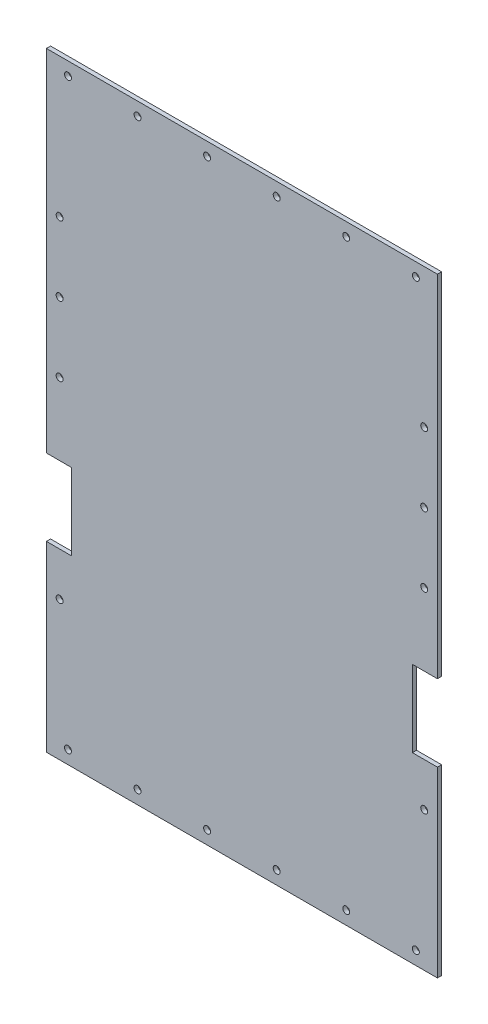
ISO-10303-21;
HEADER;
FILE_DESCRIPTION(('STEP AP214'),'2;1');
FILE_NAME('part.step','',(''),(''),'','','');
FILE_SCHEMA(('AUTOMOTIVE_DESIGN { 1 0 10303 214 1 1 1 1 }'));
ENDSEC;
DATA;
#1=APPLICATION_CONTEXT('core data for automotive mechanical design processes');
#2=APPLICATION_PROTOCOL_DEFINITION('international standard','automotive_design',2000,#1);
#3=PRODUCT_CONTEXT('',#1,'mechanical');
#4=PRODUCT('Part','Part','',(#3));
#5=PRODUCT_RELATED_PRODUCT_CATEGORY('part','',(#4));
#6=PRODUCT_DEFINITION_FORMATION('','',#4);
#7=PRODUCT_DEFINITION_CONTEXT('part definition',#1,'design');
#8=PRODUCT_DEFINITION('design','',#6,#7);
#9=PRODUCT_DEFINITION_SHAPE('','',#8);
#10=(LENGTH_UNIT() NAMED_UNIT(*) SI_UNIT(.MILLI.,.METRE.));
#11=(NAMED_UNIT(*) PLANE_ANGLE_UNIT() SI_UNIT($,.RADIAN.));
#12=(NAMED_UNIT(*) SI_UNIT($,.STERADIAN.) SOLID_ANGLE_UNIT());
#13=UNCERTAINTY_MEASURE_WITH_UNIT(LENGTH_MEASURE(1.E-05),#10,'distance_accuracy_value','');
#14=(GEOMETRIC_REPRESENTATION_CONTEXT(3) GLOBAL_UNCERTAINTY_ASSIGNED_CONTEXT((#13)) GLOBAL_UNIT_ASSIGNED_CONTEXT((#10,
#11,#12)) REPRESENTATION_CONTEXT('',''));
#15=CARTESIAN_POINT('',(0.,0.,0.));
#16=DIRECTION('',(0.,0.,1.));
#17=DIRECTION('',(1.,0.,0.));
#18=AXIS2_PLACEMENT_3D('',#15,#16,#17);
#19=CARTESIAN_POINT('',(0.,0.,3.));
#20=DIRECTION('',(1.,0.,0.));
#21=DIRECTION('',(0.,0.,-1.));
#22=AXIS2_PLACEMENT_3D('',#19,#20,#21);
#23=PLANE('',#22);
#24=DIRECTION('',(0.,-1.,0.));
#25=VECTOR('',#24,1.);
#26=CARTESIAN_POINT('',(0.,0.,0.));
#27=LINE('',#26,#25);
#28=CARTESIAN_POINT('',(0.,131.26,0.));
#29=VERTEX_POINT('',#28);
#30=CARTESIAN_POINT('',(0.,0.,0.));
#31=VERTEX_POINT('',#30);
#32=EDGE_CURVE('E168',#29,#31,#27,.T.);
#33=ORIENTED_EDGE('',*,*,#32,.T.);
#34=DIRECTION('',(0.,0.,-1.));
#35=VECTOR('',#34,1.);
#36=CARTESIAN_POINT('',(0.,0.,3.));
#37=LINE('',#36,#35);
#38=CARTESIAN_POINT('',(0.,0.,3.));
#39=VERTEX_POINT('',#38);
#40=EDGE_CURVE('E11',#39,#31,#37,.T.);
#41=ORIENTED_EDGE('',*,*,#40,.F.);
#42=DIRECTION('',(0.,-1.,0.));
#43=VECTOR('',#42,1.);
#44=CARTESIAN_POINT('',(0.,0.,3.));
#45=LINE('',#44,#43);
#46=CARTESIAN_POINT('',(0.,131.26,3.));
#47=VERTEX_POINT('',#46);
#48=EDGE_CURVE('E203',#47,#39,#45,.T.);
#49=ORIENTED_EDGE('',*,*,#48,.F.);
#50=DIRECTION('',(0.,0.,-1.));
#51=VECTOR('',#50,1.);
#52=CARTESIAN_POINT('',(0.,131.26,3.));
#53=LINE('',#52,#51);
#54=EDGE_CURVE('E164',#47,#29,#53,.T.);
#55=ORIENTED_EDGE('',*,*,#54,.T.);
#56=EDGE_LOOP('',(#33,#41,#49,#55));
#57=FACE_BOUND('',#56,.T.);
#58=ADVANCED_FACE('F43',(#57),#23,.F.);
#59=CARTESIAN_POINT('',(0.,0.,3.));
#60=DIRECTION('',(0.,1.,0.));
#61=DIRECTION('',(0.,0.,1.));
#62=AXIS2_PLACEMENT_3D('',#59,#60,#61);
#63=PLANE('',#62);
#64=DIRECTION('',(1.,0.,0.));
#65=VECTOR('',#64,1.);
#66=CARTESIAN_POINT('',(0.,0.,0.));
#67=LINE('',#66,#65);
#68=CARTESIAN_POINT('',(281.05,0.,0.));
#69=VERTEX_POINT('',#68);
#70=EDGE_CURVE('E172',#31,#69,#67,.T.);
#71=ORIENTED_EDGE('',*,*,#70,.T.);
#72=DIRECTION('',(0.,0.,-1.));
#73=VECTOR('',#72,1.);
#74=CARTESIAN_POINT('',(281.05,0.,3.));
#75=LINE('',#74,#73);
#76=CARTESIAN_POINT('',(281.05,0.,3.));
#77=VERTEX_POINT('',#76);
#78=EDGE_CURVE('E52',#77,#69,#75,.T.);
#79=ORIENTED_EDGE('',*,*,#78,.F.);
#80=DIRECTION('',(1.,0.,0.));
#81=VECTOR('',#80,1.);
#82=CARTESIAN_POINT('',(0.,0.,3.));
#83=LINE('',#82,#81);
#84=EDGE_CURVE('E115',#39,#77,#83,.T.);
#85=ORIENTED_EDGE('',*,*,#84,.F.);
#86=ORIENTED_EDGE('',*,*,#40,.T.);
#87=EDGE_LOOP('',(#71,#79,#85,#86));
#88=FACE_BOUND('',#87,.T.);
#89=ADVANCED_FACE('F298',(#88),#63,.F.);
#90=CARTESIAN_POINT('',(281.05,0.,3.));
#91=DIRECTION('',(-1.,0.,0.));
#92=DIRECTION('',(0.,0.,1.));
#93=AXIS2_PLACEMENT_3D('',#90,#91,#92);
#94=PLANE('',#93);
#95=DIRECTION('',(0.,1.,0.));
#96=VECTOR('',#95,1.);
#97=CARTESIAN_POINT('',(281.05,0.,0.));
#98=LINE('',#97,#96);
#99=CARTESIAN_POINT('',(281.05,131.26,0.));
#100=VERTEX_POINT('',#99);
#101=EDGE_CURVE('E176',#69,#100,#98,.T.);
#102=ORIENTED_EDGE('',*,*,#101,.T.);
#103=DIRECTION('',(0.,0.,-1.));
#104=VECTOR('',#103,1.);
#105=CARTESIAN_POINT('',(281.05,131.26,3.));
#106=LINE('',#105,#104);
#107=CARTESIAN_POINT('',(281.05,131.26,3.));
#108=VERTEX_POINT('',#107);
#109=EDGE_CURVE('E230',#108,#100,#106,.T.);
#110=ORIENTED_EDGE('',*,*,#109,.F.);
#111=DIRECTION('',(0.,1.,0.));
#112=VECTOR('',#111,1.);
#113=CARTESIAN_POINT('',(281.05,0.,3.));
#114=LINE('',#113,#112);
#115=EDGE_CURVE('E240',#77,#108,#114,.T.);
#116=ORIENTED_EDGE('',*,*,#115,.F.);
#117=ORIENTED_EDGE('',*,*,#78,.T.);
#118=EDGE_LOOP('',(#102,#110,#116,#117));
#119=FACE_BOUND('',#118,.T.);
#120=ADVANCED_FACE('F238',(#119),#94,.F.);
#121=CARTESIAN_POINT('',(281.05,131.26,3.));
#122=DIRECTION('',(0.,-1.,0.));
#123=DIRECTION('',(0.,0.,-1.));
#124=AXIS2_PLACEMENT_3D('',#121,#122,#123);
#125=PLANE('',#124);
#126=DIRECTION('',(-1.,0.,0.));
#127=VECTOR('',#126,1.);
#128=CARTESIAN_POINT('',(281.05,131.26,0.));
#129=LINE('',#128,#127);
#130=CARTESIAN_POINT('',(263.05,131.26,0.));
#131=VERTEX_POINT('',#130);
#132=EDGE_CURVE('E179',#100,#131,#129,.T.);
#133=ORIENTED_EDGE('',*,*,#132,.T.);
#134=DIRECTION('',(0.,0.,-1.));
#135=VECTOR('',#134,1.);
#136=CARTESIAN_POINT('',(263.05,131.26,3.));
#137=LINE('',#136,#135);
#138=CARTESIAN_POINT('',(263.05,131.26,3.));
#139=VERTEX_POINT('',#138);
#140=EDGE_CURVE('E226',#139,#131,#137,.T.);
#141=ORIENTED_EDGE('',*,*,#140,.F.);
#142=DIRECTION('',(-1.,0.,0.));
#143=VECTOR('',#142,1.);
#144=CARTESIAN_POINT('',(281.05,131.26,3.));
#145=LINE('',#144,#143);
#146=EDGE_CURVE('E259',#108,#139,#145,.T.);
#147=ORIENTED_EDGE('',*,*,#146,.F.);
#148=ORIENTED_EDGE('',*,*,#109,.T.);
#149=EDGE_LOOP('',(#133,#141,#147,#148));
#150=FACE_BOUND('',#149,.T.);
#151=ADVANCED_FACE('F249',(#150),#125,.F.);
#152=CARTESIAN_POINT('',(263.05,186.26,3.));
#153=DIRECTION('',(-1.,0.,0.));
#154=DIRECTION('',(0.,0.,1.));
#155=AXIS2_PLACEMENT_3D('',#152,#153,#154);
#156=PLANE('',#155);
#157=DIRECTION('',(0.,1.,0.));
#158=VECTOR('',#157,1.);
#159=CARTESIAN_POINT('',(263.05,186.26,0.));
#160=LINE('',#159,#158);
#161=CARTESIAN_POINT('',(263.05,186.26,0.));
#162=VERTEX_POINT('',#161);
#163=EDGE_CURVE('E182',#131,#162,#160,.T.);
#164=ORIENTED_EDGE('',*,*,#163,.T.);
#165=DIRECTION('',(0.,0.,-1.));
#166=VECTOR('',#165,1.);
#167=CARTESIAN_POINT('',(263.05,186.26,3.));
#168=LINE('',#167,#166);
#169=CARTESIAN_POINT('',(263.05,186.26,3.));
#170=VERTEX_POINT('',#169);
#171=EDGE_CURVE('E222',#170,#162,#168,.T.);
#172=ORIENTED_EDGE('',*,*,#171,.F.);
#173=DIRECTION('',(0.,1.,0.));
#174=VECTOR('',#173,1.);
#175=CARTESIAN_POINT('',(263.05,186.26,3.));
#176=LINE('',#175,#174);
#177=EDGE_CURVE('E255',#139,#170,#176,.T.);
#178=ORIENTED_EDGE('',*,*,#177,.F.);
#179=ORIENTED_EDGE('',*,*,#140,.T.);
#180=EDGE_LOOP('',(#164,#172,#178,#179));
#181=FACE_BOUND('',#180,.T.);
#182=ADVANCED_FACE('F253',(#181),#156,.F.);
#183=CARTESIAN_POINT('',(281.05,186.26,3.));
#184=DIRECTION('',(0.,1.,0.));
#185=DIRECTION('',(0.,0.,1.));
#186=AXIS2_PLACEMENT_3D('',#183,#184,#185);
#187=PLANE('',#186);
#188=DIRECTION('',(1.,0.,0.));
#189=VECTOR('',#188,1.);
#190=CARTESIAN_POINT('',(281.05,186.26,0.));
#191=LINE('',#190,#189);
#192=CARTESIAN_POINT('',(281.05,186.26,0.));
#193=VERTEX_POINT('',#192);
#194=EDGE_CURVE('E185',#162,#193,#191,.T.);
#195=ORIENTED_EDGE('',*,*,#194,.T.);
#196=DIRECTION('',(0.,0.,-1.));
#197=VECTOR('',#196,1.);
#198=CARTESIAN_POINT('',(281.05,186.26,3.));
#199=LINE('',#198,#197);
#200=CARTESIAN_POINT('',(281.05,186.26,3.));
#201=VERTEX_POINT('',#200);
#202=EDGE_CURVE('E218',#201,#193,#199,.T.);
#203=ORIENTED_EDGE('',*,*,#202,.F.);
#204=DIRECTION('',(1.,0.,0.));
#205=VECTOR('',#204,1.);
#206=CARTESIAN_POINT('',(281.05,186.26,3.));
#207=LINE('',#206,#205);
#208=EDGE_CURVE('E258',#170,#201,#207,.T.);
#209=ORIENTED_EDGE('',*,*,#208,.F.);
#210=ORIENTED_EDGE('',*,*,#171,.T.);
#211=EDGE_LOOP('',(#195,#203,#209,#210));
#212=FACE_BOUND('',#211,.T.);
#213=ADVANCED_FACE('F311',(#212),#187,.F.);
#214=CARTESIAN_POINT('',(281.05,186.26,3.));
#215=DIRECTION('',(-1.,0.,0.));
#216=DIRECTION('',(0.,0.,1.));
#217=AXIS2_PLACEMENT_3D('',#214,#215,#216);
#218=PLANE('',#217);
#219=DIRECTION('',(0.,1.,0.));
#220=VECTOR('',#219,1.);
#221=CARTESIAN_POINT('',(281.05,186.26,0.));
#222=LINE('',#221,#220);
#223=CARTESIAN_POINT('',(281.05,438.1,0.));
#224=VERTEX_POINT('',#223);
#225=EDGE_CURVE('E188',#193,#224,#222,.T.);
#226=ORIENTED_EDGE('',*,*,#225,.T.);
#227=DIRECTION('',(0.,0.,-1.));
#228=VECTOR('',#227,1.);
#229=CARTESIAN_POINT('',(281.05,438.1,3.));
#230=LINE('',#229,#228);
#231=CARTESIAN_POINT('',(281.05,438.1,3.));
#232=VERTEX_POINT('',#231);
#233=EDGE_CURVE('E214',#232,#224,#230,.T.);
#234=ORIENTED_EDGE('',*,*,#233,.F.);
#235=DIRECTION('',(0.,1.,0.));
#236=VECTOR('',#235,1.);
#237=CARTESIAN_POINT('',(281.05,186.26,3.));
#238=LINE('',#237,#236);
#239=EDGE_CURVE('E263',#201,#232,#238,.T.);
#240=ORIENTED_EDGE('',*,*,#239,.F.);
#241=ORIENTED_EDGE('',*,*,#202,.T.);
#242=EDGE_LOOP('',(#226,#234,#240,#241));
#243=FACE_BOUND('',#242,.T.);
#244=ADVANCED_FACE('F314',(#243),#218,.F.);
#245=CARTESIAN_POINT('',(0.,438.1,3.));
#246=DIRECTION('',(0.,-1.,0.));
#247=DIRECTION('',(0.,0.,-1.));
#248=AXIS2_PLACEMENT_3D('',#245,#246,#247);
#249=PLANE('',#248);
#250=DIRECTION('',(-1.,0.,0.));
#251=VECTOR('',#250,1.);
#252=CARTESIAN_POINT('',(0.,438.1,0.));
#253=LINE('',#252,#251);
#254=CARTESIAN_POINT('',(0.,438.1,0.));
#255=VERTEX_POINT('',#254);
#256=EDGE_CURVE('E191',#224,#255,#253,.T.);
#257=ORIENTED_EDGE('',*,*,#256,.T.);
#258=DIRECTION('',(0.,0.,-1.));
#259=VECTOR('',#258,1.);
#260=CARTESIAN_POINT('',(0.,438.1,3.));
#261=LINE('',#260,#259);
#262=CARTESIAN_POINT('',(0.,438.1,3.));
#263=VERTEX_POINT('',#262);
#264=EDGE_CURVE('E210',#263,#255,#261,.T.);
#265=ORIENTED_EDGE('',*,*,#264,.F.);
#266=DIRECTION('',(-1.,0.,0.));
#267=VECTOR('',#266,1.);
#268=CARTESIAN_POINT('',(0.,438.1,3.));
#269=LINE('',#268,#267);
#270=EDGE_CURVE('E270',#232,#263,#269,.T.);
#271=ORIENTED_EDGE('',*,*,#270,.F.);
#272=ORIENTED_EDGE('',*,*,#233,.T.);
#273=EDGE_LOOP('',(#257,#265,#271,#272));
#274=FACE_BOUND('',#273,.T.);
#275=ADVANCED_FACE('F278',(#274),#249,.F.);
#276=CARTESIAN_POINT('',(0.,186.26,3.));
#277=DIRECTION('',(1.,0.,0.));
#278=DIRECTION('',(0.,0.,-1.));
#279=AXIS2_PLACEMENT_3D('',#276,#277,#278);
#280=PLANE('',#279);
#281=DIRECTION('',(0.,-1.,0.));
#282=VECTOR('',#281,1.);
#283=CARTESIAN_POINT('',(0.,186.26,0.));
#284=LINE('',#283,#282);
#285=CARTESIAN_POINT('',(0.,186.26,0.));
#286=VERTEX_POINT('',#285);
#287=EDGE_CURVE('E194',#255,#286,#284,.T.);
#288=ORIENTED_EDGE('',*,*,#287,.T.);
#289=DIRECTION('',(0.,0.,-1.));
#290=VECTOR('',#289,1.);
#291=CARTESIAN_POINT('',(0.,186.26,3.));
#292=LINE('',#291,#290);
#293=CARTESIAN_POINT('',(0.,186.26,3.));
#294=VERTEX_POINT('',#293);
#295=EDGE_CURVE('E157',#294,#286,#292,.T.);
#296=ORIENTED_EDGE('',*,*,#295,.F.);
#297=DIRECTION('',(0.,-1.,0.));
#298=VECTOR('',#297,1.);
#299=CARTESIAN_POINT('',(0.,186.26,3.));
#300=LINE('',#299,#298);
#301=EDGE_CURVE('E146',#263,#294,#300,.T.);
#302=ORIENTED_EDGE('',*,*,#301,.F.);
#303=ORIENTED_EDGE('',*,*,#264,.T.);
#304=EDGE_LOOP('',(#288,#296,#302,#303));
#305=FACE_BOUND('',#304,.T.);
#306=ADVANCED_FACE('F282',(#305),#280,.F.);
#307=CARTESIAN_POINT('',(0.,186.26,3.));
#308=DIRECTION('',(0.,1.,0.));
#309=DIRECTION('',(0.,0.,1.));
#310=AXIS2_PLACEMENT_3D('',#307,#308,#309);
#311=PLANE('',#310);
#312=DIRECTION('',(1.,0.,0.));
#313=VECTOR('',#312,1.);
#314=CARTESIAN_POINT('',(0.,186.26,0.));
#315=LINE('',#314,#313);
#316=CARTESIAN_POINT('',(18.,186.26,0.));
#317=VERTEX_POINT('',#316);
#318=EDGE_CURVE('E155',#286,#317,#315,.T.);
#319=ORIENTED_EDGE('',*,*,#318,.T.);
#320=DIRECTION('',(0.,0.,-1.));
#321=VECTOR('',#320,1.);
#322=CARTESIAN_POINT('',(18.,186.26,3.));
#323=LINE('',#322,#321);
#324=CARTESIAN_POINT('',(18.,186.26,3.));
#325=VERTEX_POINT('',#324);
#326=EDGE_CURVE('E152',#325,#317,#323,.T.);
#327=ORIENTED_EDGE('',*,*,#326,.F.);
#328=DIRECTION('',(1.,0.,0.));
#329=VECTOR('',#328,1.);
#330=CARTESIAN_POINT('',(0.,186.26,3.));
#331=LINE('',#330,#329);
#332=EDGE_CURVE('E140',#294,#325,#331,.T.);
#333=ORIENTED_EDGE('',*,*,#332,.F.);
#334=ORIENTED_EDGE('',*,*,#295,.T.);
#335=EDGE_LOOP('',(#319,#327,#333,#334));
#336=FACE_BOUND('',#335,.T.);
#337=ADVANCED_FACE('F153',(#336),#311,.F.);
#338=CARTESIAN_POINT('',(18.,186.26,3.));
#339=DIRECTION('',(1.,0.,0.));
#340=DIRECTION('',(0.,1.,0.));
#341=AXIS2_PLACEMENT_3D('',#338,#339,#340);
#342=PLANE('',#341);
#343=DIRECTION('',(0.,-1.,0.));
#344=VECTOR('',#343,1.);
#345=CARTESIAN_POINT('',(18.,186.26,0.));
#346=LINE('',#345,#344);
#347=CARTESIAN_POINT('',(18.,131.26,0.));
#348=VERTEX_POINT('',#347);
#349=EDGE_CURVE('E101',#317,#348,#346,.T.);
#350=ORIENTED_EDGE('',*,*,#349,.T.);
#351=DIRECTION('',(0.,0.,-1.));
#352=VECTOR('',#351,1.);
#353=CARTESIAN_POINT('',(18.,131.26,3.));
#354=LINE('',#353,#352);
#355=CARTESIAN_POINT('',(18.,131.26,3.));
#356=VERTEX_POINT('',#355);
#357=EDGE_CURVE('E158',#356,#348,#354,.T.);
#358=ORIENTED_EDGE('',*,*,#357,.F.);
#359=DIRECTION('',(0.,-1.,0.));
#360=VECTOR('',#359,1.);
#361=CARTESIAN_POINT('',(18.,186.26,3.));
#362=LINE('',#361,#360);
#363=EDGE_CURVE('E144',#325,#356,#362,.T.);
#364=ORIENTED_EDGE('',*,*,#363,.F.);
#365=ORIENTED_EDGE('',*,*,#326,.T.);
#366=EDGE_LOOP('',(#350,#358,#364,#365));
#367=FACE_BOUND('',#366,.T.);
#368=ADVANCED_FACE('F160',(#367),#342,.F.);
#369=CARTESIAN_POINT('',(0.,131.26,3.));
#370=DIRECTION('',(0.,-1.,0.));
#371=DIRECTION('',(0.,0.,-1.));
#372=AXIS2_PLACEMENT_3D('',#369,#370,#371);
#373=PLANE('',#372);
#374=DIRECTION('',(-1.,0.,0.));
#375=VECTOR('',#374,1.);
#376=CARTESIAN_POINT('',(0.,131.26,0.));
#377=LINE('',#376,#375);
#378=EDGE_CURVE('E107',#348,#29,#377,.T.);
#379=ORIENTED_EDGE('',*,*,#378,.T.);
#380=ORIENTED_EDGE('',*,*,#54,.F.);
#381=DIRECTION('',(-1.,0.,0.));
#382=VECTOR('',#381,1.);
#383=CARTESIAN_POINT('',(0.,131.26,3.));
#384=LINE('',#383,#382);
#385=EDGE_CURVE('E60',#356,#47,#384,.T.);
#386=ORIENTED_EDGE('',*,*,#385,.F.);
#387=ORIENTED_EDGE('',*,*,#357,.T.);
#388=EDGE_LOOP('',(#379,#380,#386,#387));
#389=FACE_BOUND('',#388,.T.);
#390=ADVANCED_FACE('F286',(#389),#373,.F.);
#391=CARTESIAN_POINT('',(0.,0.,3.));
#392=DIRECTION('',(0.,0.,-1.));
#393=DIRECTION('',(-1.,0.,0.));
#394=AXIS2_PLACEMENT_3D('',#391,#392,#393);
#395=PLANE('',#394);
#396=CARTESIAN_POINT('',(271.55,100.,3.));
#397=DIRECTION('',(0.,0.,1.));
#398=DIRECTION('',(-1.,0.,0.));
#399=AXIS2_PLACEMENT_3D('',#396,#397,#398);
#400=CIRCLE('',#399,2.50000000000002);
#401=CARTESIAN_POINT('',(269.05,100.,3.));
#402=VERTEX_POINT('',#401);
#403=EDGE_CURVE('E678',#402,#402,#400,.T.);
#404=ORIENTED_EDGE('',*,*,#403,.F.);
#405=EDGE_LOOP('',(#404));
#406=FACE_BOUND('',#405,.T.);
#407=CARTESIAN_POINT('',(9.5,100.,3.));
#408=DIRECTION('',(0.,0.,1.));
#409=DIRECTION('',(1.,0.,0.));
#410=AXIS2_PLACEMENT_3D('',#407,#408,#409);
#411=CIRCLE('',#410,2.5);
#412=CARTESIAN_POINT('',(12.,100.,3.));
#413=VERTEX_POINT('',#412);
#414=EDGE_CURVE('E685',#413,#413,#411,.T.);
#415=ORIENTED_EDGE('',*,*,#414,.F.);
#416=EDGE_LOOP('',(#415));
#417=FACE_BOUND('',#416,.T.);
#418=CARTESIAN_POINT('',(9.5,238.1,3.));
#419=DIRECTION('',(0.,0.,1.));
#420=DIRECTION('',(1.,0.,0.));
#421=AXIS2_PLACEMENT_3D('',#418,#419,#420);
#422=CIRCLE('',#421,2.5);
#423=CARTESIAN_POINT('',(12.,238.1,3.));
#424=VERTEX_POINT('',#423);
#425=EDGE_CURVE('E806',#424,#424,#422,.T.);
#426=ORIENTED_EDGE('',*,*,#425,.F.);
#427=EDGE_LOOP('',(#426));
#428=FACE_BOUND('',#427,.T.);
#429=CARTESIAN_POINT('',(9.5,288.1,3.));
#430=DIRECTION('',(0.,0.,1.));
#431=DIRECTION('',(1.,0.,0.));
#432=AXIS2_PLACEMENT_3D('',#429,#430,#431);
#433=CIRCLE('',#432,2.5);
#434=CARTESIAN_POINT('',(12.,288.1,3.));
#435=VERTEX_POINT('',#434);
#436=EDGE_CURVE('E798',#435,#435,#433,.T.);
#437=ORIENTED_EDGE('',*,*,#436,.F.);
#438=EDGE_LOOP('',(#437));
#439=FACE_BOUND('',#438,.T.);
#440=CARTESIAN_POINT('',(265.525,9.4999999999999,3.));
#441=DIRECTION('',(0.,0.,1.));
#442=DIRECTION('',(1.,0.,0.));
#443=AXIS2_PLACEMENT_3D('',#440,#441,#442);
#444=CIRCLE('',#443,2.50000000000002);
#445=CARTESIAN_POINT('',(268.025,9.4999999999999,3.));
#446=VERTEX_POINT('',#445);
#447=EDGE_CURVE('E724',#446,#446,#444,.T.);
#448=ORIENTED_EDGE('',*,*,#447,.F.);
#449=EDGE_LOOP('',(#448));
#450=FACE_BOUND('',#449,.T.);
#451=CARTESIAN_POINT('',(15.525,9.49999999999995,3.));
#452=DIRECTION('',(0.,0.,1.));
#453=DIRECTION('',(-1.,0.,0.));
#454=AXIS2_PLACEMENT_3D('',#451,#452,#453);
#455=CIRCLE('',#454,2.5);
#456=CARTESIAN_POINT('',(13.025,9.49999999999995,3.));
#457=VERTEX_POINT('',#456);
#458=EDGE_CURVE('E774',#457,#457,#455,.T.);
#459=ORIENTED_EDGE('',*,*,#458,.F.);
#460=EDGE_LOOP('',(#459));
#461=FACE_BOUND('',#460,.T.);
#462=CARTESIAN_POINT('',(115.525,9.50000000000001,3.));
#463=DIRECTION('',(0.,0.,1.));
#464=DIRECTION('',(-1.,0.,0.));
#465=AXIS2_PLACEMENT_3D('',#462,#463,#464);
#466=CIRCLE('',#465,2.50000000000001);
#467=CARTESIAN_POINT('',(113.025,9.50000000000001,3.));
#468=VERTEX_POINT('',#467);
#469=EDGE_CURVE('E782',#468,#468,#466,.T.);
#470=ORIENTED_EDGE('',*,*,#469,.F.);
#471=EDGE_LOOP('',(#470));
#472=FACE_BOUND('',#471,.T.);
#473=CARTESIAN_POINT('',(65.525,9.50000000000001,3.));
#474=DIRECTION('',(0.,0.,1.));
#475=DIRECTION('',(-1.,0.,0.));
#476=AXIS2_PLACEMENT_3D('',#473,#474,#475);
#477=CIRCLE('',#476,2.49999999999999);
#478=CARTESIAN_POINT('',(63.025,9.50000000000001,3.));
#479=VERTEX_POINT('',#478);
#480=EDGE_CURVE('E790',#479,#479,#477,.T.);
#481=ORIENTED_EDGE('',*,*,#480,.F.);
#482=EDGE_LOOP('',(#481));
#483=FACE_BOUND('',#482,.T.);
#484=CARTESIAN_POINT('',(115.525,428.6,3.));
#485=DIRECTION('',(0.,0.,1.));
#486=DIRECTION('',(1.,0.,0.));
#487=AXIS2_PLACEMENT_3D('',#484,#485,#486);
#488=CIRCLE('',#487,2.50000000000001);
#489=CARTESIAN_POINT('',(118.025,428.6,3.));
#490=VERTEX_POINT('',#489);
#491=EDGE_CURVE('E725',#490,#490,#488,.T.);
#492=ORIENTED_EDGE('',*,*,#491,.F.);
#493=EDGE_LOOP('',(#492));
#494=FACE_BOUND('',#493,.T.);
#495=CARTESIAN_POINT('',(15.525,428.6,3.));
#496=DIRECTION('',(0.,0.,1.));
#497=DIRECTION('',(1.,0.,0.));
#498=AXIS2_PLACEMENT_3D('',#495,#496,#497);
#499=CIRCLE('',#498,2.5);
#500=CARTESIAN_POINT('',(18.025,428.6,3.));
#501=VERTEX_POINT('',#500);
#502=EDGE_CURVE('E734',#501,#501,#499,.T.);
#503=ORIENTED_EDGE('',*,*,#502,.F.);
#504=EDGE_LOOP('',(#503));
#505=FACE_BOUND('',#504,.T.);
#506=CARTESIAN_POINT('',(265.525,428.6,3.));
#507=DIRECTION('',(0.,0.,1.));
#508=DIRECTION('',(-1.,0.,0.));
#509=AXIS2_PLACEMENT_3D('',#506,#507,#508);
#510=CIRCLE('',#509,2.50000000000002);
#511=CARTESIAN_POINT('',(263.025,428.6,3.));
#512=VERTEX_POINT('',#511);
#513=EDGE_CURVE('E742',#512,#512,#510,.T.);
#514=ORIENTED_EDGE('',*,*,#513,.F.);
#515=EDGE_LOOP('',(#514));
#516=FACE_BOUND('',#515,.T.);
#517=CARTESIAN_POINT('',(165.525,428.6,3.));
#518=DIRECTION('',(0.,0.,1.));
#519=DIRECTION('',(-1.,0.,0.));
#520=AXIS2_PLACEMENT_3D('',#517,#518,#519);
#521=CIRCLE('',#520,2.5);
#522=CARTESIAN_POINT('',(163.025,428.6,3.));
#523=VERTEX_POINT('',#522);
#524=EDGE_CURVE('E750',#523,#523,#521,.T.);
#525=ORIENTED_EDGE('',*,*,#524,.F.);
#526=EDGE_LOOP('',(#525));
#527=FACE_BOUND('',#526,.T.);
#528=CARTESIAN_POINT('',(215.525,428.6,3.));
#529=DIRECTION('',(0.,0.,1.));
#530=DIRECTION('',(-1.,0.,0.));
#531=AXIS2_PLACEMENT_3D('',#528,#529,#530);
#532=CIRCLE('',#531,2.5);
#533=CARTESIAN_POINT('',(213.025,428.6,3.));
#534=VERTEX_POINT('',#533);
#535=EDGE_CURVE('E691',#534,#534,#532,.T.);
#536=ORIENTED_EDGE('',*,*,#535,.F.);
#537=EDGE_LOOP('',(#536));
#538=FACE_BOUND('',#537,.T.);
#539=CARTESIAN_POINT('',(9.5,338.1,3.));
#540=DIRECTION('',(0.,0.,1.));
#541=DIRECTION('',(1.,0.,0.));
#542=AXIS2_PLACEMENT_3D('',#539,#540,#541);
#543=CIRCLE('',#542,2.5);
#544=CARTESIAN_POINT('',(12.,338.1,3.));
#545=VERTEX_POINT('',#544);
#546=EDGE_CURVE('E700',#545,#545,#543,.T.);
#547=ORIENTED_EDGE('',*,*,#546,.F.);
#548=EDGE_LOOP('',(#547));
#549=FACE_BOUND('',#548,.T.);
#550=CARTESIAN_POINT('',(215.525,9.50000000000001,3.));
#551=DIRECTION('',(0.,0.,1.));
#552=DIRECTION('',(1.,0.,0.));
#553=AXIS2_PLACEMENT_3D('',#550,#551,#552);
#554=CIRCLE('',#553,2.5);
#555=CARTESIAN_POINT('',(218.025,9.50000000000001,3.));
#556=VERTEX_POINT('',#555);
#557=EDGE_CURVE('E708',#556,#556,#554,.T.);
#558=ORIENTED_EDGE('',*,*,#557,.F.);
#559=EDGE_LOOP('',(#558));
#560=FACE_BOUND('',#559,.T.);
#561=CARTESIAN_POINT('',(165.525,9.50000000000001,3.));
#562=DIRECTION('',(0.,0.,1.));
#563=DIRECTION('',(1.,0.,0.));
#564=AXIS2_PLACEMENT_3D('',#561,#562,#563);
#565=CIRCLE('',#564,2.5);
#566=CARTESIAN_POINT('',(168.025,9.50000000000001,3.));
#567=VERTEX_POINT('',#566);
#568=EDGE_CURVE('E716',#567,#567,#565,.T.);
#569=ORIENTED_EDGE('',*,*,#568,.F.);
#570=EDGE_LOOP('',(#569));
#571=FACE_BOUND('',#570,.T.);
#572=CARTESIAN_POINT('',(271.55,238.1,3.));
#573=DIRECTION('',(0.,0.,1.));
#574=DIRECTION('',(-1.,0.,0.));
#575=AXIS2_PLACEMENT_3D('',#572,#573,#574);
#576=CIRCLE('',#575,2.50000000000002);
#577=CARTESIAN_POINT('',(269.05,238.1,3.));
#578=VERTEX_POINT('',#577);
#579=EDGE_CURVE('E687',#578,#578,#576,.T.);
#580=ORIENTED_EDGE('',*,*,#579,.F.);
#581=EDGE_LOOP('',(#580));
#582=FACE_BOUND('',#581,.T.);
#583=CARTESIAN_POINT('',(271.55,288.1,3.));
#584=DIRECTION('',(0.,0.,1.));
#585=DIRECTION('',(-1.,0.,0.));
#586=AXIS2_PLACEMENT_3D('',#583,#584,#585);
#587=CIRCLE('',#586,2.50000000000002);
#588=CARTESIAN_POINT('',(269.05,288.1,3.));
#589=VERTEX_POINT('',#588);
#590=EDGE_CURVE('E831',#589,#589,#587,.T.);
#591=ORIENTED_EDGE('',*,*,#590,.F.);
#592=EDGE_LOOP('',(#591));
#593=FACE_BOUND('',#592,.T.);
#594=CARTESIAN_POINT('',(271.55,338.1,3.));
#595=DIRECTION('',(0.,0.,1.));
#596=DIRECTION('',(-1.,0.,0.));
#597=AXIS2_PLACEMENT_3D('',#594,#595,#596);
#598=CIRCLE('',#597,2.50000000000002);
#599=CARTESIAN_POINT('',(269.05,338.1,3.));
#600=VERTEX_POINT('',#599);
#601=EDGE_CURVE('E823',#600,#600,#598,.T.);
#602=ORIENTED_EDGE('',*,*,#601,.F.);
#603=EDGE_LOOP('',(#602));
#604=FACE_BOUND('',#603,.T.);
#605=CARTESIAN_POINT('',(65.525,428.6,3.));
#606=DIRECTION('',(0.,0.,1.));
#607=DIRECTION('',(1.,0.,0.));
#608=AXIS2_PLACEMENT_3D('',#605,#606,#607);
#609=CIRCLE('',#608,2.50000000000001);
#610=CARTESIAN_POINT('',(68.025,428.6,3.));
#611=VERTEX_POINT('',#610);
#612=EDGE_CURVE('E729',#611,#611,#609,.T.);
#613=ORIENTED_EDGE('',*,*,#612,.F.);
#614=EDGE_LOOP('',(#613));
#615=FACE_BOUND('',#614,.T.);
#616=ORIENTED_EDGE('',*,*,#48,.T.);
#617=ORIENTED_EDGE('',*,*,#84,.T.);
#618=ORIENTED_EDGE('',*,*,#115,.T.);
#619=ORIENTED_EDGE('',*,*,#146,.T.);
#620=ORIENTED_EDGE('',*,*,#177,.T.);
#621=ORIENTED_EDGE('',*,*,#208,.T.);
#622=ORIENTED_EDGE('',*,*,#239,.T.);
#623=ORIENTED_EDGE('',*,*,#270,.T.);
#624=ORIENTED_EDGE('',*,*,#301,.T.);
#625=ORIENTED_EDGE('',*,*,#332,.T.);
#626=ORIENTED_EDGE('',*,*,#363,.T.);
#627=ORIENTED_EDGE('',*,*,#385,.T.);
#628=EDGE_LOOP('',(#616,#617,#618,#619,#620,#621,#622,#623,#624,#625,#626,#627));
#629=FACE_BOUND('',#628,.T.);
#630=ADVANCED_FACE('F142',(#406,#417,#428,#439,#450,#461,#472,#483,#494,#505,#516,#527,#538,
#549,#560,#571,#582,#593,#604,#615,#629),#395,.F.);
#631=CARTESIAN_POINT('',(0.,0.,0.));
#632=DIRECTION('',(0.,0.,-1.));
#633=DIRECTION('',(-1.,0.,0.));
#634=AXIS2_PLACEMENT_3D('',#631,#632,#633);
#635=PLANE('',#634);
#636=CARTESIAN_POINT('',(271.55,100.,0.));
#637=DIRECTION('',(0.,0.,1.));
#638=DIRECTION('',(-1.,0.,0.));
#639=AXIS2_PLACEMENT_3D('',#636,#637,#638);
#640=CIRCLE('',#639,2.50000000000002);
#641=CARTESIAN_POINT('',(269.05,100.,0.));
#642=VERTEX_POINT('',#641);
#643=EDGE_CURVE('E675',#642,#642,#640,.T.);
#644=ORIENTED_EDGE('',*,*,#643,.T.);
#645=EDGE_LOOP('',(#644));
#646=FACE_BOUND('',#645,.T.);
#647=CARTESIAN_POINT('',(9.5,100.,0.));
#648=DIRECTION('',(0.,0.,1.));
#649=DIRECTION('',(1.,0.,0.));
#650=AXIS2_PLACEMENT_3D('',#647,#648,#649);
#651=CIRCLE('',#650,2.5);
#652=CARTESIAN_POINT('',(12.,100.,0.));
#653=VERTEX_POINT('',#652);
#654=EDGE_CURVE('E680',#653,#653,#651,.T.);
#655=ORIENTED_EDGE('',*,*,#654,.T.);
#656=EDGE_LOOP('',(#655));
#657=FACE_BOUND('',#656,.T.);
#658=CARTESIAN_POINT('',(9.5,238.1,0.));
#659=DIRECTION('',(0.,0.,1.));
#660=DIRECTION('',(1.,0.,0.));
#661=AXIS2_PLACEMENT_3D('',#658,#659,#660);
#662=CIRCLE('',#661,2.5);
#663=CARTESIAN_POINT('',(12.,238.1,0.));
#664=VERTEX_POINT('',#663);
#665=EDGE_CURVE('E810',#664,#664,#662,.T.);
#666=ORIENTED_EDGE('',*,*,#665,.T.);
#667=EDGE_LOOP('',(#666));
#668=FACE_BOUND('',#667,.T.);
#669=CARTESIAN_POINT('',(9.5,288.1,0.));
#670=DIRECTION('',(0.,0.,1.));
#671=DIRECTION('',(1.,0.,0.));
#672=AXIS2_PLACEMENT_3D('',#669,#670,#671);
#673=CIRCLE('',#672,2.5);
#674=CARTESIAN_POINT('',(12.,288.1,0.));
#675=VERTEX_POINT('',#674);
#676=EDGE_CURVE('E802',#675,#675,#673,.T.);
#677=ORIENTED_EDGE('',*,*,#676,.T.);
#678=EDGE_LOOP('',(#677));
#679=FACE_BOUND('',#678,.T.);
#680=CARTESIAN_POINT('',(265.525,9.4999999999999,0.));
#681=DIRECTION('',(0.,0.,1.));
#682=DIRECTION('',(1.,0.,0.));
#683=AXIS2_PLACEMENT_3D('',#680,#681,#682);
#684=CIRCLE('',#683,2.50000000000002);
#685=CARTESIAN_POINT('',(268.025,9.4999999999999,0.));
#686=VERTEX_POINT('',#685);
#687=EDGE_CURVE('E770',#686,#686,#684,.T.);
#688=ORIENTED_EDGE('',*,*,#687,.T.);
#689=EDGE_LOOP('',(#688));
#690=FACE_BOUND('',#689,.T.);
#691=CARTESIAN_POINT('',(15.525,9.49999999999995,0.));
#692=DIRECTION('',(0.,0.,1.));
#693=DIRECTION('',(-1.,0.,0.));
#694=AXIS2_PLACEMENT_3D('',#691,#692,#693);
#695=CIRCLE('',#694,2.5);
#696=CARTESIAN_POINT('',(13.025,9.49999999999995,0.));
#697=VERTEX_POINT('',#696);
#698=EDGE_CURVE('E778',#697,#697,#695,.T.);
#699=ORIENTED_EDGE('',*,*,#698,.T.);
#700=EDGE_LOOP('',(#699));
#701=FACE_BOUND('',#700,.T.);
#702=CARTESIAN_POINT('',(115.525,9.50000000000001,0.));
#703=DIRECTION('',(0.,0.,1.));
#704=DIRECTION('',(-1.,0.,0.));
#705=AXIS2_PLACEMENT_3D('',#702,#703,#704);
#706=CIRCLE('',#705,2.50000000000001);
#707=CARTESIAN_POINT('',(113.025,9.50000000000001,0.));
#708=VERTEX_POINT('',#707);
#709=EDGE_CURVE('E786',#708,#708,#706,.T.);
#710=ORIENTED_EDGE('',*,*,#709,.T.);
#711=EDGE_LOOP('',(#710));
#712=FACE_BOUND('',#711,.T.);
#713=CARTESIAN_POINT('',(65.525,9.50000000000001,0.));
#714=DIRECTION('',(0.,0.,1.));
#715=DIRECTION('',(-1.,0.,0.));
#716=AXIS2_PLACEMENT_3D('',#713,#714,#715);
#717=CIRCLE('',#716,2.49999999999999);
#718=CARTESIAN_POINT('',(63.025,9.50000000000001,0.));
#719=VERTEX_POINT('',#718);
#720=EDGE_CURVE('E794',#719,#719,#717,.T.);
#721=ORIENTED_EDGE('',*,*,#720,.T.);
#722=EDGE_LOOP('',(#721));
#723=FACE_BOUND('',#722,.T.);
#724=CARTESIAN_POINT('',(115.525,428.6,0.));
#725=DIRECTION('',(0.,0.,1.));
#726=DIRECTION('',(1.,0.,0.));
#727=AXIS2_PLACEMENT_3D('',#724,#725,#726);
#728=CIRCLE('',#727,2.50000000000001);
#729=CARTESIAN_POINT('',(118.025,428.6,0.));
#730=VERTEX_POINT('',#729);
#731=EDGE_CURVE('E730',#730,#730,#728,.T.);
#732=ORIENTED_EDGE('',*,*,#731,.T.);
#733=EDGE_LOOP('',(#732));
#734=FACE_BOUND('',#733,.T.);
#735=CARTESIAN_POINT('',(15.525,428.6,0.));
#736=DIRECTION('',(0.,0.,1.));
#737=DIRECTION('',(1.,0.,0.));
#738=AXIS2_PLACEMENT_3D('',#735,#736,#737);
#739=CIRCLE('',#738,2.5);
#740=CARTESIAN_POINT('',(18.025,428.6,0.));
#741=VERTEX_POINT('',#740);
#742=EDGE_CURVE('E738',#741,#741,#739,.T.);
#743=ORIENTED_EDGE('',*,*,#742,.T.);
#744=EDGE_LOOP('',(#743));
#745=FACE_BOUND('',#744,.T.);
#746=CARTESIAN_POINT('',(265.525,428.6,0.));
#747=DIRECTION('',(0.,0.,1.));
#748=DIRECTION('',(-1.,0.,0.));
#749=AXIS2_PLACEMENT_3D('',#746,#747,#748);
#750=CIRCLE('',#749,2.50000000000002);
#751=CARTESIAN_POINT('',(263.025,428.6,0.));
#752=VERTEX_POINT('',#751);
#753=EDGE_CURVE('E746',#752,#752,#750,.T.);
#754=ORIENTED_EDGE('',*,*,#753,.T.);
#755=EDGE_LOOP('',(#754));
#756=FACE_BOUND('',#755,.T.);
#757=CARTESIAN_POINT('',(165.525,428.6,0.));
#758=DIRECTION('',(0.,0.,1.));
#759=DIRECTION('',(-1.,0.,0.));
#760=AXIS2_PLACEMENT_3D('',#757,#758,#759);
#761=CIRCLE('',#760,2.5);
#762=CARTESIAN_POINT('',(163.025,428.6,0.));
#763=VERTEX_POINT('',#762);
#764=EDGE_CURVE('E695',#763,#763,#761,.T.);
#765=ORIENTED_EDGE('',*,*,#764,.T.);
#766=EDGE_LOOP('',(#765));
#767=FACE_BOUND('',#766,.T.);
#768=CARTESIAN_POINT('',(215.525,428.6,0.));
#769=DIRECTION('',(0.,0.,1.));
#770=DIRECTION('',(-1.,0.,0.));
#771=AXIS2_PLACEMENT_3D('',#768,#769,#770);
#772=CIRCLE('',#771,2.5);
#773=CARTESIAN_POINT('',(213.025,428.6,0.));
#774=VERTEX_POINT('',#773);
#775=EDGE_CURVE('E696',#774,#774,#772,.T.);
#776=ORIENTED_EDGE('',*,*,#775,.T.);
#777=EDGE_LOOP('',(#776));
#778=FACE_BOUND('',#777,.T.);
#779=CARTESIAN_POINT('',(9.5,338.1,0.));
#780=DIRECTION('',(0.,0.,1.));
#781=DIRECTION('',(1.,0.,0.));
#782=AXIS2_PLACEMENT_3D('',#779,#780,#781);
#783=CIRCLE('',#782,2.5);
#784=CARTESIAN_POINT('',(12.,338.1,0.));
#785=VERTEX_POINT('',#784);
#786=EDGE_CURVE('E704',#785,#785,#783,.T.);
#787=ORIENTED_EDGE('',*,*,#786,.T.);
#788=EDGE_LOOP('',(#787));
#789=FACE_BOUND('',#788,.T.);
#790=CARTESIAN_POINT('',(215.525,9.50000000000001,0.));
#791=DIRECTION('',(0.,0.,1.));
#792=DIRECTION('',(1.,0.,0.));
#793=AXIS2_PLACEMENT_3D('',#790,#791,#792);
#794=CIRCLE('',#793,2.5);
#795=CARTESIAN_POINT('',(218.025,9.50000000000001,0.));
#796=VERTEX_POINT('',#795);
#797=EDGE_CURVE('E712',#796,#796,#794,.T.);
#798=ORIENTED_EDGE('',*,*,#797,.T.);
#799=EDGE_LOOP('',(#798));
#800=FACE_BOUND('',#799,.T.);
#801=CARTESIAN_POINT('',(165.525,9.50000000000001,0.));
#802=DIRECTION('',(0.,0.,1.));
#803=DIRECTION('',(1.,0.,0.));
#804=AXIS2_PLACEMENT_3D('',#801,#802,#803);
#805=CIRCLE('',#804,2.5);
#806=CARTESIAN_POINT('',(168.025,9.50000000000001,0.));
#807=VERTEX_POINT('',#806);
#808=EDGE_CURVE('E720',#807,#807,#805,.T.);
#809=ORIENTED_EDGE('',*,*,#808,.T.);
#810=EDGE_LOOP('',(#809));
#811=FACE_BOUND('',#810,.T.);
#812=CARTESIAN_POINT('',(271.55,238.1,0.));
#813=DIRECTION('',(0.,0.,1.));
#814=DIRECTION('',(-1.,0.,0.));
#815=AXIS2_PLACEMENT_3D('',#812,#813,#814);
#816=CIRCLE('',#815,2.50000000000002);
#817=CARTESIAN_POINT('',(269.05,238.1,0.));
#818=VERTEX_POINT('',#817);
#819=EDGE_CURVE('E835',#818,#818,#816,.T.);
#820=ORIENTED_EDGE('',*,*,#819,.T.);
#821=EDGE_LOOP('',(#820));
#822=FACE_BOUND('',#821,.T.);
#823=CARTESIAN_POINT('',(271.55,288.1,0.));
#824=DIRECTION('',(0.,0.,1.));
#825=DIRECTION('',(-1.,0.,0.));
#826=AXIS2_PLACEMENT_3D('',#823,#824,#825);
#827=CIRCLE('',#826,2.50000000000002);
#828=CARTESIAN_POINT('',(269.05,288.1,0.));
#829=VERTEX_POINT('',#828);
#830=EDGE_CURVE('E827',#829,#829,#827,.T.);
#831=ORIENTED_EDGE('',*,*,#830,.T.);
#832=EDGE_LOOP('',(#831));
#833=FACE_BOUND('',#832,.T.);
#834=CARTESIAN_POINT('',(271.55,338.1,0.));
#835=DIRECTION('',(0.,0.,1.));
#836=DIRECTION('',(-1.,0.,0.));
#837=AXIS2_PLACEMENT_3D('',#834,#835,#836);
#838=CIRCLE('',#837,2.50000000000002);
#839=CARTESIAN_POINT('',(269.05,338.1,0.));
#840=VERTEX_POINT('',#839);
#841=EDGE_CURVE('E819',#840,#840,#838,.T.);
#842=ORIENTED_EDGE('',*,*,#841,.T.);
#843=EDGE_LOOP('',(#842));
#844=FACE_BOUND('',#843,.T.);
#845=CARTESIAN_POINT('',(65.525,428.6,0.));
#846=DIRECTION('',(0.,0.,1.));
#847=DIRECTION('',(1.,0.,0.));
#848=AXIS2_PLACEMENT_3D('',#845,#846,#847);
#849=CIRCLE('',#848,2.50000000000001);
#850=CARTESIAN_POINT('',(68.025,428.6,0.));
#851=VERTEX_POINT('',#850);
#852=EDGE_CURVE('E173',#851,#851,#849,.T.);
#853=ORIENTED_EDGE('',*,*,#852,.T.);
#854=EDGE_LOOP('',(#853));
#855=FACE_BOUND('',#854,.T.);
#856=ORIENTED_EDGE('',*,*,#32,.F.);
#857=ORIENTED_EDGE('',*,*,#378,.F.);
#858=ORIENTED_EDGE('',*,*,#349,.F.);
#859=ORIENTED_EDGE('',*,*,#318,.F.);
#860=ORIENTED_EDGE('',*,*,#287,.F.);
#861=ORIENTED_EDGE('',*,*,#256,.F.);
#862=ORIENTED_EDGE('',*,*,#225,.F.);
#863=ORIENTED_EDGE('',*,*,#194,.F.);
#864=ORIENTED_EDGE('',*,*,#163,.F.);
#865=ORIENTED_EDGE('',*,*,#132,.F.);
#866=ORIENTED_EDGE('',*,*,#101,.F.);
#867=ORIENTED_EDGE('',*,*,#70,.F.);
#868=EDGE_LOOP('',(#856,#857,#858,#859,#860,#861,#862,#863,#864,#865,#866,#867));
#869=FACE_BOUND('',#868,.T.);
#870=ADVANCED_FACE('F244',(#646,#657,#668,#679,#690,#701,#712,#723,#734,#745,#756,#767,#778,
#789,#800,#811,#822,#833,#844,#855,#869),#635,.T.);
#871=CARTESIAN_POINT('',(65.525,428.6,0.));
#872=DIRECTION('',(0.,0.,1.));
#873=DIRECTION('',(1.,0.,0.));
#874=AXIS2_PLACEMENT_3D('',#871,#872,#873);
#875=CYLINDRICAL_SURFACE('',#874,2.50000000000001);
#876=ORIENTED_EDGE('',*,*,#852,.F.);
#877=EDGE_LOOP('',(#876));
#878=FACE_BOUND('',#877,.T.);
#879=ORIENTED_EDGE('',*,*,#612,.T.);
#880=EDGE_LOOP('',(#879));
#881=FACE_BOUND('',#880,.T.);
#882=ADVANCED_FACE('F354',(#878,#881),#875,.F.);
#883=CARTESIAN_POINT('',(271.55,338.1,0.));
#884=DIRECTION('',(0.,0.,1.));
#885=DIRECTION('',(1.,0.,0.));
#886=AXIS2_PLACEMENT_3D('',#883,#884,#885);
#887=CYLINDRICAL_SURFACE('',#886,2.50000000000002);
#888=ORIENTED_EDGE('',*,*,#841,.F.);
#889=EDGE_LOOP('',(#888));
#890=FACE_BOUND('',#889,.T.);
#891=ORIENTED_EDGE('',*,*,#601,.T.);
#892=EDGE_LOOP('',(#891));
#893=FACE_BOUND('',#892,.T.);
#894=ADVANCED_FACE('F364',(#890,#893),#887,.F.);
#895=CARTESIAN_POINT('',(271.55,288.1,0.));
#896=DIRECTION('',(0.,0.,1.));
#897=DIRECTION('',(1.,0.,0.));
#898=AXIS2_PLACEMENT_3D('',#895,#896,#897);
#899=CYLINDRICAL_SURFACE('',#898,2.50000000000002);
#900=ORIENTED_EDGE('',*,*,#830,.F.);
#901=EDGE_LOOP('',(#900));
#902=FACE_BOUND('',#901,.T.);
#903=ORIENTED_EDGE('',*,*,#590,.T.);
#904=EDGE_LOOP('',(#903));
#905=FACE_BOUND('',#904,.T.);
#906=ADVANCED_FACE('F375',(#902,#905),#899,.F.);
#907=CARTESIAN_POINT('',(271.55,238.1,0.));
#908=DIRECTION('',(0.,0.,1.));
#909=DIRECTION('',(1.,0.,0.));
#910=AXIS2_PLACEMENT_3D('',#907,#908,#909);
#911=CYLINDRICAL_SURFACE('',#910,2.50000000000002);
#912=ORIENTED_EDGE('',*,*,#819,.F.);
#913=EDGE_LOOP('',(#912));
#914=FACE_BOUND('',#913,.T.);
#915=ORIENTED_EDGE('',*,*,#579,.T.);
#916=EDGE_LOOP('',(#915));
#917=FACE_BOUND('',#916,.T.);
#918=ADVANCED_FACE('F386',(#914,#917),#911,.F.);
#919=CARTESIAN_POINT('',(165.525,9.50000000000001,0.));
#920=DIRECTION('',(0.,0.,1.));
#921=DIRECTION('',(1.,0.,0.));
#922=AXIS2_PLACEMENT_3D('',#919,#920,#921);
#923=CYLINDRICAL_SURFACE('',#922,2.5);
#924=ORIENTED_EDGE('',*,*,#808,.F.);
#925=EDGE_LOOP('',(#924));
#926=FACE_BOUND('',#925,.T.);
#927=ORIENTED_EDGE('',*,*,#568,.T.);
#928=EDGE_LOOP('',(#927));
#929=FACE_BOUND('',#928,.T.);
#930=ADVANCED_FACE('F397',(#926,#929),#923,.F.);
#931=CARTESIAN_POINT('',(215.525,9.50000000000001,0.));
#932=DIRECTION('',(0.,0.,1.));
#933=DIRECTION('',(1.,0.,0.));
#934=AXIS2_PLACEMENT_3D('',#931,#932,#933);
#935=CYLINDRICAL_SURFACE('',#934,2.5);
#936=ORIENTED_EDGE('',*,*,#797,.F.);
#937=EDGE_LOOP('',(#936));
#938=FACE_BOUND('',#937,.T.);
#939=ORIENTED_EDGE('',*,*,#557,.T.);
#940=EDGE_LOOP('',(#939));
#941=FACE_BOUND('',#940,.T.);
#942=ADVANCED_FACE('F408',(#938,#941),#935,.F.);
#943=CARTESIAN_POINT('',(9.5,338.1,0.));
#944=DIRECTION('',(0.,0.,1.));
#945=DIRECTION('',(1.,0.,0.));
#946=AXIS2_PLACEMENT_3D('',#943,#944,#945);
#947=CYLINDRICAL_SURFACE('',#946,2.5);
#948=ORIENTED_EDGE('',*,*,#786,.F.);
#949=EDGE_LOOP('',(#948));
#950=FACE_BOUND('',#949,.T.);
#951=ORIENTED_EDGE('',*,*,#546,.T.);
#952=EDGE_LOOP('',(#951));
#953=FACE_BOUND('',#952,.T.);
#954=ADVANCED_FACE('F419',(#950,#953),#947,.F.);
#955=CARTESIAN_POINT('',(215.525,428.6,0.));
#956=DIRECTION('',(0.,0.,1.));
#957=DIRECTION('',(1.,0.,0.));
#958=AXIS2_PLACEMENT_3D('',#955,#956,#957);
#959=CYLINDRICAL_SURFACE('',#958,2.5);
#960=ORIENTED_EDGE('',*,*,#775,.F.);
#961=EDGE_LOOP('',(#960));
#962=FACE_BOUND('',#961,.T.);
#963=ORIENTED_EDGE('',*,*,#535,.T.);
#964=EDGE_LOOP('',(#963));
#965=FACE_BOUND('',#964,.T.);
#966=ADVANCED_FACE('F430',(#962,#965),#959,.F.);
#967=CARTESIAN_POINT('',(165.525,428.6,0.));
#968=DIRECTION('',(0.,0.,1.));
#969=DIRECTION('',(1.,0.,0.));
#970=AXIS2_PLACEMENT_3D('',#967,#968,#969);
#971=CYLINDRICAL_SURFACE('',#970,2.5);
#972=ORIENTED_EDGE('',*,*,#764,.F.);
#973=EDGE_LOOP('',(#972));
#974=FACE_BOUND('',#973,.T.);
#975=ORIENTED_EDGE('',*,*,#524,.T.);
#976=EDGE_LOOP('',(#975));
#977=FACE_BOUND('',#976,.T.);
#978=ADVANCED_FACE('F441',(#974,#977),#971,.F.);
#979=CARTESIAN_POINT('',(265.525,428.6,0.));
#980=DIRECTION('',(0.,0.,1.));
#981=DIRECTION('',(1.,0.,0.));
#982=AXIS2_PLACEMENT_3D('',#979,#980,#981);
#983=CYLINDRICAL_SURFACE('',#982,2.50000000000002);
#984=ORIENTED_EDGE('',*,*,#753,.F.);
#985=EDGE_LOOP('',(#984));
#986=FACE_BOUND('',#985,.T.);
#987=ORIENTED_EDGE('',*,*,#513,.T.);
#988=EDGE_LOOP('',(#987));
#989=FACE_BOUND('',#988,.T.);
#990=ADVANCED_FACE('F452',(#986,#989),#983,.F.);
#991=CARTESIAN_POINT('',(15.525,428.6,0.));
#992=DIRECTION('',(0.,0.,1.));
#993=DIRECTION('',(1.,0.,0.));
#994=AXIS2_PLACEMENT_3D('',#991,#992,#993);
#995=CYLINDRICAL_SURFACE('',#994,2.5);
#996=ORIENTED_EDGE('',*,*,#742,.F.);
#997=EDGE_LOOP('',(#996));
#998=FACE_BOUND('',#997,.T.);
#999=ORIENTED_EDGE('',*,*,#502,.T.);
#1000=EDGE_LOOP('',(#999));
#1001=FACE_BOUND('',#1000,.T.);
#1002=ADVANCED_FACE('F463',(#998,#1001),#995,.F.);
#1003=CARTESIAN_POINT('',(115.525,428.6,0.));
#1004=DIRECTION('',(0.,0.,1.));
#1005=DIRECTION('',(1.,0.,0.));
#1006=AXIS2_PLACEMENT_3D('',#1003,#1004,#1005);
#1007=CYLINDRICAL_SURFACE('',#1006,2.50000000000001);
#1008=ORIENTED_EDGE('',*,*,#731,.F.);
#1009=EDGE_LOOP('',(#1008));
#1010=FACE_BOUND('',#1009,.T.);
#1011=ORIENTED_EDGE('',*,*,#491,.T.);
#1012=EDGE_LOOP('',(#1011));
#1013=FACE_BOUND('',#1012,.T.);
#1014=ADVANCED_FACE('F474',(#1010,#1013),#1007,.F.);
#1015=CARTESIAN_POINT('',(65.525,9.50000000000001,0.));
#1016=DIRECTION('',(0.,0.,1.));
#1017=DIRECTION('',(1.,0.,0.));
#1018=AXIS2_PLACEMENT_3D('',#1015,#1016,#1017);
#1019=CYLINDRICAL_SURFACE('',#1018,2.49999999999999);
#1020=ORIENTED_EDGE('',*,*,#720,.F.);
#1021=EDGE_LOOP('',(#1020));
#1022=FACE_BOUND('',#1021,.T.);
#1023=ORIENTED_EDGE('',*,*,#480,.T.);
#1024=EDGE_LOOP('',(#1023));
#1025=FACE_BOUND('',#1024,.T.);
#1026=ADVANCED_FACE('F485',(#1022,#1025),#1019,.F.);
#1027=CARTESIAN_POINT('',(115.525,9.50000000000001,0.));
#1028=DIRECTION('',(0.,0.,1.));
#1029=DIRECTION('',(1.,0.,0.));
#1030=AXIS2_PLACEMENT_3D('',#1027,#1028,#1029);
#1031=CYLINDRICAL_SURFACE('',#1030,2.50000000000001);
#1032=ORIENTED_EDGE('',*,*,#709,.F.);
#1033=EDGE_LOOP('',(#1032));
#1034=FACE_BOUND('',#1033,.T.);
#1035=ORIENTED_EDGE('',*,*,#469,.T.);
#1036=EDGE_LOOP('',(#1035));
#1037=FACE_BOUND('',#1036,.T.);
#1038=ADVANCED_FACE('F496',(#1034,#1037),#1031,.F.);
#1039=CARTESIAN_POINT('',(15.525,9.49999999999995,0.));
#1040=DIRECTION('',(0.,0.,1.));
#1041=DIRECTION('',(1.,0.,0.));
#1042=AXIS2_PLACEMENT_3D('',#1039,#1040,#1041);
#1043=CYLINDRICAL_SURFACE('',#1042,2.5);
#1044=ORIENTED_EDGE('',*,*,#698,.F.);
#1045=EDGE_LOOP('',(#1044));
#1046=FACE_BOUND('',#1045,.T.);
#1047=ORIENTED_EDGE('',*,*,#458,.T.);
#1048=EDGE_LOOP('',(#1047));
#1049=FACE_BOUND('',#1048,.T.);
#1050=ADVANCED_FACE('F507',(#1046,#1049),#1043,.F.);
#1051=CARTESIAN_POINT('',(265.525,9.4999999999999,0.));
#1052=DIRECTION('',(0.,0.,1.));
#1053=DIRECTION('',(1.,0.,0.));
#1054=AXIS2_PLACEMENT_3D('',#1051,#1052,#1053);
#1055=CYLINDRICAL_SURFACE('',#1054,2.50000000000002);
#1056=ORIENTED_EDGE('',*,*,#687,.F.);
#1057=EDGE_LOOP('',(#1056));
#1058=FACE_BOUND('',#1057,.T.);
#1059=ORIENTED_EDGE('',*,*,#447,.T.);
#1060=EDGE_LOOP('',(#1059));
#1061=FACE_BOUND('',#1060,.T.);
#1062=ADVANCED_FACE('F518',(#1058,#1061),#1055,.F.);
#1063=CARTESIAN_POINT('',(9.5,288.1,0.));
#1064=DIRECTION('',(0.,0.,1.));
#1065=DIRECTION('',(1.,0.,0.));
#1066=AXIS2_PLACEMENT_3D('',#1063,#1064,#1065);
#1067=CYLINDRICAL_SURFACE('',#1066,2.5);
#1068=ORIENTED_EDGE('',*,*,#676,.F.);
#1069=EDGE_LOOP('',(#1068));
#1070=FACE_BOUND('',#1069,.T.);
#1071=ORIENTED_EDGE('',*,*,#436,.T.);
#1072=EDGE_LOOP('',(#1071));
#1073=FACE_BOUND('',#1072,.T.);
#1074=ADVANCED_FACE('F529',(#1070,#1073),#1067,.F.);
#1075=CARTESIAN_POINT('',(9.5,238.1,0.));
#1076=DIRECTION('',(0.,0.,1.));
#1077=DIRECTION('',(1.,0.,0.));
#1078=AXIS2_PLACEMENT_3D('',#1075,#1076,#1077);
#1079=CYLINDRICAL_SURFACE('',#1078,2.5);
#1080=ORIENTED_EDGE('',*,*,#665,.F.);
#1081=EDGE_LOOP('',(#1080));
#1082=FACE_BOUND('',#1081,.T.);
#1083=ORIENTED_EDGE('',*,*,#425,.T.);
#1084=EDGE_LOOP('',(#1083));
#1085=FACE_BOUND('',#1084,.T.);
#1086=ADVANCED_FACE('F540',(#1082,#1085),#1079,.F.);
#1087=CARTESIAN_POINT('',(9.5,100.,0.));
#1088=DIRECTION('',(0.,0.,1.));
#1089=DIRECTION('',(1.,0.,0.));
#1090=AXIS2_PLACEMENT_3D('',#1087,#1088,#1089);
#1091=CYLINDRICAL_SURFACE('',#1090,2.5);
#1092=ORIENTED_EDGE('',*,*,#654,.F.);
#1093=EDGE_LOOP('',(#1092));
#1094=FACE_BOUND('',#1093,.T.);
#1095=ORIENTED_EDGE('',*,*,#414,.T.);
#1096=EDGE_LOOP('',(#1095));
#1097=FACE_BOUND('',#1096,.T.);
#1098=ADVANCED_FACE('F551',(#1094,#1097),#1091,.F.);
#1099=CARTESIAN_POINT('',(271.55,100.,0.));
#1100=DIRECTION('',(0.,0.,1.));
#1101=DIRECTION('',(1.,0.,0.));
#1102=AXIS2_PLACEMENT_3D('',#1099,#1100,#1101);
#1103=CYLINDRICAL_SURFACE('',#1102,2.50000000000002);
#1104=ORIENTED_EDGE('',*,*,#643,.F.);
#1105=EDGE_LOOP('',(#1104));
#1106=FACE_BOUND('',#1105,.T.);
#1107=ORIENTED_EDGE('',*,*,#403,.T.);
#1108=EDGE_LOOP('',(#1107));
#1109=FACE_BOUND('',#1108,.T.);
#1110=ADVANCED_FACE('F562',(#1106,#1109),#1103,.F.);
#1111=CLOSED_SHELL('',(#58,#89,#120,#151,#182,#213,#244,#275,#306,#337,#368,#390,#630,#870,#882,
#894,#906,#918,#930,#942,#954,#966,#978,#990,#1002,#1014,#1026,#1038,#1050,#1062,#1074,#1086,
#1098,#1110));
#1112=MANIFOLD_SOLID_BREP('B2',#1111);
#1113=ADVANCED_BREP_SHAPE_REPRESENTATION('',(#18,#1112),#14);
#1114=SHAPE_DEFINITION_REPRESENTATION(#9,#1113);
ENDSEC;
END-ISO-10303-21;
